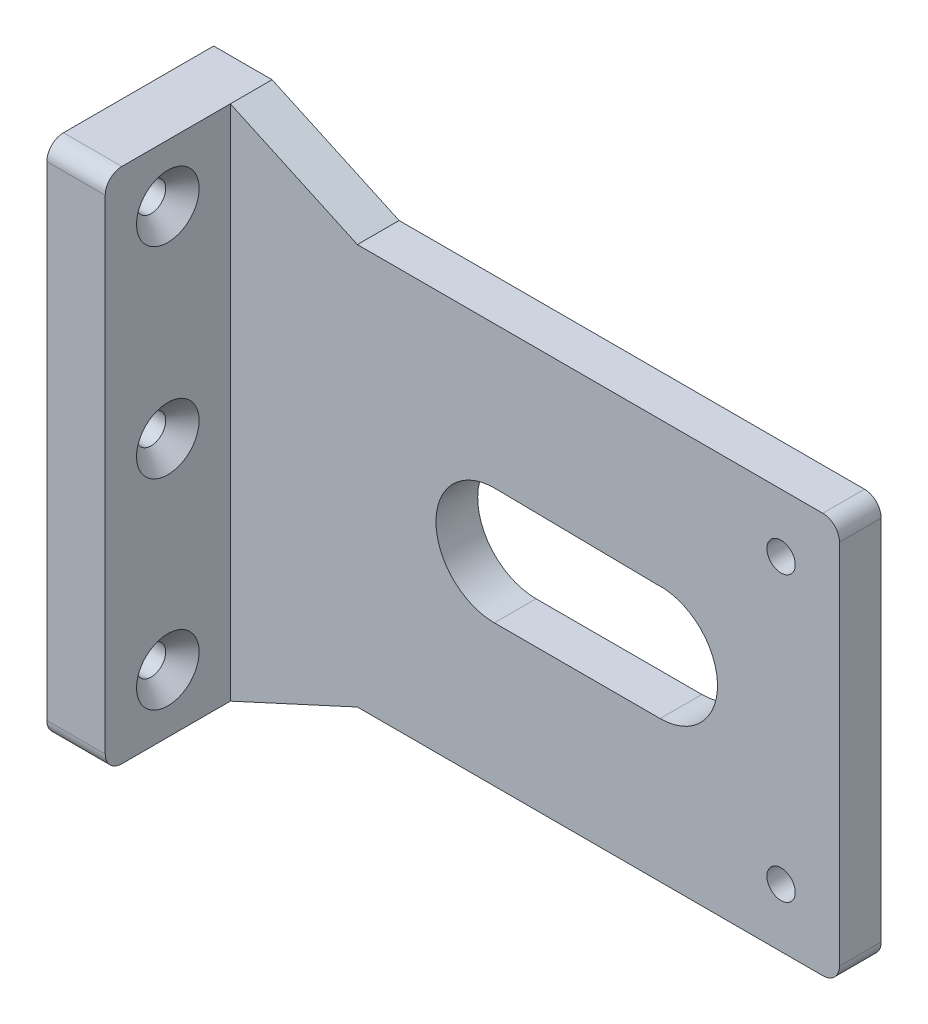
ISO-10303-21;
HEADER;
FILE_DESCRIPTION(('STEP AP214'),'2;1');
FILE_NAME('part.step','',(''),(''),'','','');
FILE_SCHEMA(('AUTOMOTIVE_DESIGN { 1 0 10303 214 1 1 1 1 }'));
ENDSEC;
DATA;
#1=APPLICATION_CONTEXT('core data for automotive mechanical design processes');
#2=APPLICATION_PROTOCOL_DEFINITION('international standard','automotive_design',2000,#1);
#3=PRODUCT_CONTEXT('',#1,'mechanical');
#4=PRODUCT('Part','Part','',(#3));
#5=PRODUCT_RELATED_PRODUCT_CATEGORY('part','',(#4));
#6=PRODUCT_DEFINITION_FORMATION('','',#4);
#7=PRODUCT_DEFINITION_CONTEXT('part definition',#1,'design');
#8=PRODUCT_DEFINITION('design','',#6,#7);
#9=PRODUCT_DEFINITION_SHAPE('','',#8);
#10=(LENGTH_UNIT() NAMED_UNIT(*) SI_UNIT(.MILLI.,.METRE.));
#11=(NAMED_UNIT(*) PLANE_ANGLE_UNIT() SI_UNIT($,.RADIAN.));
#12=(NAMED_UNIT(*) SI_UNIT($,.STERADIAN.) SOLID_ANGLE_UNIT());
#13=UNCERTAINTY_MEASURE_WITH_UNIT(LENGTH_MEASURE(1.E-05),#10,'distance_accuracy_value','');
#14=(GEOMETRIC_REPRESENTATION_CONTEXT(3) GLOBAL_UNCERTAINTY_ASSIGNED_CONTEXT((#13)) GLOBAL_UNIT_ASSIGNED_CONTEXT((#10,
#11,#12)) REPRESENTATION_CONTEXT('',''));
#15=CARTESIAN_POINT('',(0.,0.,0.));
#16=DIRECTION('',(0.,0.,1.));
#17=DIRECTION('',(1.,0.,0.));
#18=AXIS2_PLACEMENT_3D('',#15,#16,#17);
#19=CARTESIAN_POINT('',(-26.4932645391117,23.8191772918906,5.));
#20=DIRECTION('',(0.,0.,-1.));
#21=DIRECTION('',(-1.,0.,0.));
#22=AXIS2_PLACEMENT_3D('',#19,#20,#21);
#23=CYLINDRICAL_SURFACE('',#22,6.87362968464459);
#24=CARTESIAN_POINT('',(-26.4932645391117,23.8191772918906,0.));
#25=DIRECTION('',(0.,0.,1.));
#26=DIRECTION('',(1.,0.,0.));
#27=AXIS2_PLACEMENT_3D('',#24,#25,#26);
#28=CIRCLE('',#27,6.87362968464459);
#29=CARTESIAN_POINT('',(-26.4932645391116,16.9455476072461,0.));
#30=VERTEX_POINT('',#29);
#31=CARTESIAN_POINT('',(-27.0133943087637,30.6730995313349,0.));
#32=VERTEX_POINT('',#31);
#33=EDGE_CURVE('E248',#30,#32,#28,.T.);
#34=ORIENTED_EDGE('',*,*,#33,.F.);
#35=DIRECTION('',(0.,0.,-1.));
#36=VECTOR('',#35,1.);
#37=CARTESIAN_POINT('',(-26.4932645391116,16.9455476072461,5.));
#38=LINE('',#37,#36);
#39=CARTESIAN_POINT('',(-26.4932645391116,16.9455476072461,5.));
#40=VERTEX_POINT('',#39);
#41=EDGE_CURVE('E263',#40,#30,#38,.T.);
#42=ORIENTED_EDGE('',*,*,#41,.F.);
#43=CARTESIAN_POINT('',(-26.4932645391117,23.8191772918906,5.));
#44=DIRECTION('',(0.,0.,1.));
#45=DIRECTION('',(1.,0.,0.));
#46=AXIS2_PLACEMENT_3D('',#43,#44,#45);
#47=CIRCLE('',#46,6.87362968464459);
#48=CARTESIAN_POINT('',(-27.0133943087637,30.6730995313349,5.));
#49=VERTEX_POINT('',#48);
#50=EDGE_CURVE('E212',#40,#49,#47,.T.);
#51=ORIENTED_EDGE('',*,*,#50,.T.);
#52=DIRECTION('',(0.,0.,-1.));
#53=VECTOR('',#52,1.);
#54=CARTESIAN_POINT('',(-27.0133943087637,30.6730995313349,5.));
#55=LINE('',#54,#53);
#56=EDGE_CURVE('E256',#49,#32,#55,.T.);
#57=ORIENTED_EDGE('',*,*,#56,.T.);
#58=EDGE_LOOP('',(#34,#42,#51,#57));
#59=FACE_BOUND('',#58,.T.);
#60=ADVANCED_FACE('F35',(#59),#23,.F.);
#61=CARTESIAN_POINT('',(0.,16.9455476072461,5.));
#62=DIRECTION('',(0.,-1.,0.));
#63=DIRECTION('',(1.,0.,0.));
#64=AXIS2_PLACEMENT_3D('',#61,#62,#63);
#65=PLANE('',#64);
#66=DIRECTION('',(-1.,0.,0.));
#67=VECTOR('',#66,1.);
#68=CARTESIAN_POINT('',(0.,16.9455476072461,0.));
#69=LINE('',#68,#67);
#70=CARTESIAN_POINT('',(-46.3600354353213,16.9455476072461,0.));
#71=VERTEX_POINT('',#70);
#72=EDGE_CURVE('E251',#30,#71,#69,.T.);
#73=ORIENTED_EDGE('',*,*,#72,.T.);
#74=DIRECTION('',(0.,0.,-1.));
#75=VECTOR('',#74,1.);
#76=CARTESIAN_POINT('',(-46.3600354353213,16.9455476072461,5.));
#77=LINE('',#76,#75);
#78=CARTESIAN_POINT('',(-46.3600354353213,16.9455476072461,5.));
#79=VERTEX_POINT('',#78);
#80=EDGE_CURVE('E261',#79,#71,#77,.T.);
#81=ORIENTED_EDGE('',*,*,#80,.F.);
#82=DIRECTION('',(-1.,0.,0.));
#83=VECTOR('',#82,1.);
#84=CARTESIAN_POINT('',(0.,16.9455476072461,5.));
#85=LINE('',#84,#83);
#86=EDGE_CURVE('E215',#40,#79,#85,.T.);
#87=ORIENTED_EDGE('',*,*,#86,.F.);
#88=ORIENTED_EDGE('',*,*,#41,.T.);
#89=EDGE_LOOP('',(#73,#81,#87,#88));
#90=FACE_BOUND('',#89,.T.);
#91=ADVANCED_FACE('F366',(#90),#65,.F.);
#92=CARTESIAN_POINT('',(-46.3600354353213,23.9455476072461,5.));
#93=DIRECTION('',(0.,0.,-1.));
#94=DIRECTION('',(-1.,0.,0.));
#95=AXIS2_PLACEMENT_3D('',#92,#93,#94);
#96=CYLINDRICAL_SURFACE('',#95,7.);
#97=CARTESIAN_POINT('',(-46.3600354353213,23.9455476072461,0.));
#98=DIRECTION('',(0.,0.,1.));
#99=DIRECTION('',(1.,0.,0.));
#100=AXIS2_PLACEMENT_3D('',#97,#98,#99);
#101=CIRCLE('',#100,7.);
#102=CARTESIAN_POINT('',(-46.1629202483037,30.9427717427906,0.));
#103=VERTEX_POINT('',#102);
#104=EDGE_CURVE('E198',#103,#71,#101,.T.);
#105=ORIENTED_EDGE('',*,*,#104,.F.);
#106=DIRECTION('',(0.,0.,-1.));
#107=VECTOR('',#106,1.);
#108=CARTESIAN_POINT('',(-46.1629202483037,30.9427717427906,5.));
#109=LINE('',#108,#107);
#110=CARTESIAN_POINT('',(-46.1629202483037,30.9427717427906,5.));
#111=VERTEX_POINT('',#110);
#112=EDGE_CURVE('E258',#111,#103,#109,.T.);
#113=ORIENTED_EDGE('',*,*,#112,.F.);
#114=CARTESIAN_POINT('',(-46.3600354353213,23.9455476072461,5.));
#115=DIRECTION('',(0.,0.,1.));
#116=DIRECTION('',(1.,0.,0.));
#117=AXIS2_PLACEMENT_3D('',#114,#115,#116);
#118=CIRCLE('',#117,7.);
#119=EDGE_CURVE('E217',#111,#79,#118,.T.);
#120=ORIENTED_EDGE('',*,*,#119,.T.);
#121=ORIENTED_EDGE('',*,*,#80,.T.);
#122=EDGE_LOOP('',(#105,#113,#120,#121));
#123=FACE_BOUND('',#122,.T.);
#124=ADVANCED_FACE('F372',(#123),#96,.F.);
#125=CARTESIAN_POINT('',(0.,55.,5.));
#126=DIRECTION('',(0.,1.,0.));
#127=DIRECTION('',(0.,0.,1.));
#128=AXIS2_PLACEMENT_3D('',#125,#126,#127);
#129=PLANE('',#128);
#130=DIRECTION('',(0.,0.,-1.));
#131=VECTOR('',#130,1.);
#132=CARTESIAN_POINT('',(-85.,55.,5.));
#133=LINE('',#132,#131);
#134=CARTESIAN_POINT('',(-85.,55.,18.));
#135=VERTEX_POINT('',#134);
#136=CARTESIAN_POINT('',(-85.,55.,0.));
#137=VERTEX_POINT('',#136);
#138=EDGE_CURVE('E259',#135,#137,#133,.T.);
#139=ORIENTED_EDGE('',*,*,#138,.F.);
#140=DIRECTION('',(1.,0.,0.));
#141=VECTOR('',#140,1.);
#142=CARTESIAN_POINT('',(0.,55.,18.));
#143=LINE('',#142,#141);
#144=CARTESIAN_POINT('',(-78.,55.,18.));
#145=VERTEX_POINT('',#144);
#146=EDGE_CURVE('E308',#135,#145,#143,.T.);
#147=ORIENTED_EDGE('',*,*,#146,.T.);
#148=DIRECTION('',(0.,0.,-1.));
#149=VECTOR('',#148,1.);
#150=CARTESIAN_POINT('',(-78.,55.,20.));
#151=LINE('',#150,#149);
#152=CARTESIAN_POINT('',(-78.,55.,5.));
#153=VERTEX_POINT('',#152);
#154=EDGE_CURVE('E165',#145,#153,#151,.T.);
#155=ORIENTED_EDGE('',*,*,#154,.T.);
#156=DIRECTION('',(0.,0.,-1.));
#157=VECTOR('',#156,1.);
#158=CARTESIAN_POINT('',(-78.,55.,5.));
#159=LINE('',#158,#157);
#160=CARTESIAN_POINT('',(-78.,55.,0.));
#161=VERTEX_POINT('',#160);
#162=EDGE_CURVE('E222',#153,#161,#159,.T.);
#163=ORIENTED_EDGE('',*,*,#162,.T.);
#164=DIRECTION('',(1.,0.,0.));
#165=VECTOR('',#164,1.);
#166=CARTESIAN_POINT('',(0.,55.,0.));
#167=LINE('',#166,#165);
#168=EDGE_CURVE('E177',#137,#161,#167,.T.);
#169=ORIENTED_EDGE('',*,*,#168,.F.);
#170=EDGE_LOOP('',(#139,#147,#155,#163,#169));
#171=FACE_BOUND('',#170,.T.);
#172=ADVANCED_FACE('F328',(#171),#129,.T.);
#173=CARTESIAN_POINT('',(-85.,0.,5.));
#174=DIRECTION('',(1.,0.,0.));
#175=DIRECTION('',(0.,0.,-1.));
#176=AXIS2_PLACEMENT_3D('',#173,#174,#175);
#177=PLANE('',#176);
#178=CARTESIAN_POINT('',(-85.,24.,12.5));
#179=DIRECTION('',(1.,0.,0.));
#180=DIRECTION('',(0.,0.,-1.));
#181=AXIS2_PLACEMENT_3D('',#178,#179,#180);
#182=CIRCLE('',#181,1.75);
#183=CARTESIAN_POINT('',(-85.,24.,10.75));
#184=VERTEX_POINT('',#183);
#185=EDGE_CURVE('E341',#184,#184,#182,.T.);
#186=ORIENTED_EDGE('',*,*,#185,.T.);
#187=EDGE_LOOP('',(#186));
#188=FACE_BOUND('',#187,.T.);
#189=CARTESIAN_POINT('',(-85.,48.1060776493848,12.5));
#190=DIRECTION('',(1.,0.,0.));
#191=DIRECTION('',(0.,0.,-1.));
#192=AXIS2_PLACEMENT_3D('',#189,#190,#191);
#193=CIRCLE('',#192,1.75);
#194=CARTESIAN_POINT('',(-85.,48.1060776493848,10.75));
#195=VERTEX_POINT('',#194);
#196=EDGE_CURVE('E344',#195,#195,#193,.T.);
#197=ORIENTED_EDGE('',*,*,#196,.T.);
#198=EDGE_LOOP('',(#197));
#199=FACE_BOUND('',#198,.T.);
#200=CARTESIAN_POINT('',(-85.,0.,12.5));
#201=DIRECTION('',(1.,0.,0.));
#202=DIRECTION('',(0.,0.,-1.));
#203=AXIS2_PLACEMENT_3D('',#200,#201,#202);
#204=CIRCLE('',#203,1.75);
#205=CARTESIAN_POINT('',(-85.,0.,10.75));
#206=VERTEX_POINT('',#205);
#207=EDGE_CURVE('E336',#206,#206,#204,.T.);
#208=ORIENTED_EDGE('',*,*,#207,.T.);
#209=EDGE_LOOP('',(#208));
#210=FACE_BOUND('',#209,.T.);
#211=DIRECTION('',(0.,-1.,0.));
#212=VECTOR('',#211,1.);
#213=CARTESIAN_POINT('',(-85.,0.,20.));
#214=LINE('',#213,#212);
#215=CARTESIAN_POINT('',(-85.,53.,20.));
#216=VERTEX_POINT('',#215);
#217=CARTESIAN_POINT('',(-85.,-5.,20.));
#218=VERTEX_POINT('',#217);
#219=EDGE_CURVE('E322',#216,#218,#214,.T.);
#220=ORIENTED_EDGE('',*,*,#219,.F.);
#221=CARTESIAN_POINT('',(-85.,53.,18.));
#222=DIRECTION('',(1.,0.,0.));
#223=DIRECTION('',(0.,0.,-1.));
#224=AXIS2_PLACEMENT_3D('',#221,#222,#223);
#225=CIRCLE('',#224,2.);
#226=EDGE_CURVE('E43',#216,#135,#225,.F.);
#227=ORIENTED_EDGE('',*,*,#226,.T.);
#228=ORIENTED_EDGE('',*,*,#138,.T.);
#229=DIRECTION('',(0.,-1.,0.));
#230=VECTOR('',#229,1.);
#231=CARTESIAN_POINT('',(-85.,0.,0.));
#232=LINE('',#231,#230);
#233=CARTESIAN_POINT('',(-85.,-7.,0.));
#234=VERTEX_POINT('',#233);
#235=EDGE_CURVE('E225',#137,#234,#232,.T.);
#236=ORIENTED_EDGE('',*,*,#235,.T.);
#237=DIRECTION('',(0.,0.,-1.));
#238=VECTOR('',#237,1.);
#239=CARTESIAN_POINT('',(-85.,-7.,5.));
#240=LINE('',#239,#238);
#241=CARTESIAN_POINT('',(-85.,-7.,18.));
#242=VERTEX_POINT('',#241);
#243=EDGE_CURVE('E187',#242,#234,#240,.T.);
#244=ORIENTED_EDGE('',*,*,#243,.F.);
#245=CARTESIAN_POINT('',(-85.,-5.,18.));
#246=DIRECTION('',(1.,0.,0.));
#247=DIRECTION('',(0.,0.,-1.));
#248=AXIS2_PLACEMENT_3D('',#245,#246,#247);
#249=CIRCLE('',#248,2.);
#250=EDGE_CURVE('E50',#242,#218,#249,.F.);
#251=ORIENTED_EDGE('',*,*,#250,.T.);
#252=EDGE_LOOP('',(#220,#227,#228,#236,#244,#251));
#253=FACE_BOUND('',#252,.T.);
#254=ADVANCED_FACE('F320',(#188,#199,#210,#253),#177,.F.);
#255=CARTESIAN_POINT('',(0.,-7.,5.));
#256=DIRECTION('',(0.,-1.,0.));
#257=DIRECTION('',(0.,0.,-1.));
#258=AXIS2_PLACEMENT_3D('',#255,#256,#257);
#259=PLANE('',#258);
#260=DIRECTION('',(0.,0.,-1.));
#261=VECTOR('',#260,1.);
#262=CARTESIAN_POINT('',(-78.,-7.,20.));
#263=LINE('',#262,#261);
#264=CARTESIAN_POINT('',(-78.,-7.,18.));
#265=VERTEX_POINT('',#264);
#266=CARTESIAN_POINT('',(-78.,-7.,5.));
#267=VERTEX_POINT('',#266);
#268=EDGE_CURVE('E154',#265,#267,#263,.T.);
#269=ORIENTED_EDGE('',*,*,#268,.F.);
#270=DIRECTION('',(-1.,0.,0.));
#271=VECTOR('',#270,1.);
#272=CARTESIAN_POINT('',(0.,-7.,18.));
#273=LINE('',#272,#271);
#274=EDGE_CURVE('E11',#265,#242,#273,.T.);
#275=ORIENTED_EDGE('',*,*,#274,.T.);
#276=ORIENTED_EDGE('',*,*,#243,.T.);
#277=DIRECTION('',(-1.,0.,0.));
#278=VECTOR('',#277,1.);
#279=CARTESIAN_POINT('',(0.,-7.,0.));
#280=LINE('',#279,#278);
#281=CARTESIAN_POINT('',(-78.,-7.,0.));
#282=VERTEX_POINT('',#281);
#283=EDGE_CURVE('E183',#282,#234,#280,.T.);
#284=ORIENTED_EDGE('',*,*,#283,.F.);
#285=DIRECTION('',(0.,0.,-1.));
#286=VECTOR('',#285,1.);
#287=CARTESIAN_POINT('',(-78.,-7.,5.));
#288=LINE('',#287,#286);
#289=EDGE_CURVE('E180',#267,#282,#288,.T.);
#290=ORIENTED_EDGE('',*,*,#289,.F.);
#291=EDGE_LOOP('',(#269,#275,#276,#284,#290));
#292=FACE_BOUND('',#291,.T.);
#293=ADVANCED_FACE('F181',(#292),#259,.T.);
#294=CARTESIAN_POINT('',(-10.9580010754682,23.8294035119056,5.));
#295=DIRECTION('',(0.417794694081964,-0.908541464984927,0.));
#296=DIRECTION('',(0.908541464984927,0.417794694081964,0.));
#297=AXIS2_PLACEMENT_3D('',#294,#295,#296);
#298=PLANE('',#297);
#299=DIRECTION('',(-0.908541464984927,-0.417794694081964,0.));
#300=VECTOR('',#299,1.);
#301=CARTESIAN_POINT('',(-10.9580010754682,23.8294035119056,0.));
#302=LINE('',#301,#300);
#303=CARTESIAN_POINT('',(-62.7777141620501,0.,0.));
#304=VERTEX_POINT('',#303);
#305=EDGE_CURVE('E229',#304,#282,#302,.T.);
#306=ORIENTED_EDGE('',*,*,#305,.F.);
#307=DIRECTION('',(0.,0.,-1.));
#308=VECTOR('',#307,1.);
#309=CARTESIAN_POINT('',(-62.7777141620501,0.,5.));
#310=LINE('',#309,#308);
#311=CARTESIAN_POINT('',(-62.7777141620501,0.,5.));
#312=VERTEX_POINT('',#311);
#313=EDGE_CURVE('E188',#312,#304,#310,.T.);
#314=ORIENTED_EDGE('',*,*,#313,.F.);
#315=DIRECTION('',(-0.908541464984927,-0.417794694081964,0.));
#316=VECTOR('',#315,1.);
#317=CARTESIAN_POINT('',(-10.9580010754682,23.8294035119056,5.));
#318=LINE('',#317,#316);
#319=EDGE_CURVE('E174',#312,#267,#318,.T.);
#320=ORIENTED_EDGE('',*,*,#319,.T.);
#321=ORIENTED_EDGE('',*,*,#289,.T.);
#322=EDGE_LOOP('',(#306,#314,#320,#321));
#323=FACE_BOUND('',#322,.T.);
#324=ADVANCED_FACE('F190',(#323),#298,.T.);
#325=CARTESIAN_POINT('',(0.,0.,5.));
#326=DIRECTION('',(0.,1.,0.));
#327=DIRECTION('',(-1.,0.,0.));
#328=AXIS2_PLACEMENT_3D('',#325,#326,#327);
#329=PLANE('',#328);
#330=DIRECTION('',(1.,0.,0.));
#331=VECTOR('',#330,1.);
#332=CARTESIAN_POINT('',(0.,0.,0.));
#333=LINE('',#332,#331);
#334=CARTESIAN_POINT('',(-7.,0.,0.));
#335=VERTEX_POINT('',#334);
#336=EDGE_CURVE('E231',#304,#335,#333,.T.);
#337=ORIENTED_EDGE('',*,*,#336,.T.);
#338=DIRECTION('',(0.,0.,-1.));
#339=VECTOR('',#338,1.);
#340=CARTESIAN_POINT('',(-7.,0.,5.));
#341=LINE('',#340,#339);
#342=CARTESIAN_POINT('',(-7.,0.,5.));
#343=VERTEX_POINT('',#342);
#344=EDGE_CURVE('E299',#335,#343,#341,.F.);
#345=ORIENTED_EDGE('',*,*,#344,.T.);
#346=DIRECTION('',(1.,0.,0.));
#347=VECTOR('',#346,1.);
#348=CARTESIAN_POINT('',(0.,0.,5.));
#349=LINE('',#348,#347);
#350=EDGE_CURVE('E192',#312,#343,#349,.T.);
#351=ORIENTED_EDGE('',*,*,#350,.F.);
#352=ORIENTED_EDGE('',*,*,#313,.T.);
#353=EDGE_LOOP('',(#337,#345,#351,#352));
#354=FACE_BOUND('',#353,.T.);
#355=ADVANCED_FACE('F398',(#354),#329,.F.);
#356=CARTESIAN_POINT('',(-5.,0.,5.));
#357=DIRECTION('',(-1.,0.,0.));
#358=DIRECTION('',(0.,0.,1.));
#359=AXIS2_PLACEMENT_3D('',#356,#357,#358);
#360=PLANE('',#359);
#361=DIRECTION('',(0.,1.,0.));
#362=VECTOR('',#361,1.);
#363=CARTESIAN_POINT('',(-5.,0.,5.));
#364=LINE('',#363,#362);
#365=CARTESIAN_POINT('',(-5.,2.,5.));
#366=VERTEX_POINT('',#365);
#367=CARTESIAN_POINT('',(-5.,46.,5.));
#368=VERTEX_POINT('',#367);
#369=EDGE_CURVE('E195',#366,#368,#364,.T.);
#370=ORIENTED_EDGE('',*,*,#369,.F.);
#371=DIRECTION('',(0.,0.,-1.));
#372=VECTOR('',#371,1.);
#373=CARTESIAN_POINT('',(-5.,2.,5.));
#374=LINE('',#373,#372);
#375=CARTESIAN_POINT('',(-5.,2.,0.));
#376=VERTEX_POINT('',#375);
#377=EDGE_CURVE('E292',#366,#376,#374,.T.);
#378=ORIENTED_EDGE('',*,*,#377,.T.);
#379=DIRECTION('',(0.,1.,0.));
#380=VECTOR('',#379,1.);
#381=CARTESIAN_POINT('',(-5.,0.,0.));
#382=LINE('',#381,#380);
#383=CARTESIAN_POINT('',(-5.,46.,0.));
#384=VERTEX_POINT('',#383);
#385=EDGE_CURVE('E234',#376,#384,#382,.T.);
#386=ORIENTED_EDGE('',*,*,#385,.T.);
#387=DIRECTION('',(0.,0.,-1.));
#388=VECTOR('',#387,1.);
#389=CARTESIAN_POINT('',(-5.,46.,5.));
#390=LINE('',#389,#388);
#391=EDGE_CURVE('E290',#384,#368,#390,.F.);
#392=ORIENTED_EDGE('',*,*,#391,.T.);
#393=EDGE_LOOP('',(#370,#378,#386,#392));
#394=FACE_BOUND('',#393,.T.);
#395=ADVANCED_FACE('F394',(#394),#360,.F.);
#396=CARTESIAN_POINT('',(0.,48.,5.));
#397=DIRECTION('',(0.,-1.,0.));
#398=DIRECTION('',(1.,0.,0.));
#399=AXIS2_PLACEMENT_3D('',#396,#397,#398);
#400=PLANE('',#399);
#401=DIRECTION('',(-1.,0.,0.));
#402=VECTOR('',#401,1.);
#403=CARTESIAN_POINT('',(0.,48.,5.));
#404=LINE('',#403,#402);
#405=CARTESIAN_POINT('',(-7.,48.,5.));
#406=VERTEX_POINT('',#405);
#407=CARTESIAN_POINT('',(-62.7777141620501,48.,5.));
#408=VERTEX_POINT('',#407);
#409=EDGE_CURVE('E203',#406,#408,#404,.T.);
#410=ORIENTED_EDGE('',*,*,#409,.F.);
#411=DIRECTION('',(0.,0.,-1.));
#412=VECTOR('',#411,1.);
#413=CARTESIAN_POINT('',(-7.,48.,5.));
#414=LINE('',#413,#412);
#415=CARTESIAN_POINT('',(-7.,48.,0.));
#416=VERTEX_POINT('',#415);
#417=EDGE_CURVE('E305',#406,#416,#414,.T.);
#418=ORIENTED_EDGE('',*,*,#417,.T.);
#419=DIRECTION('',(-1.,0.,0.));
#420=VECTOR('',#419,1.);
#421=CARTESIAN_POINT('',(0.,48.,0.));
#422=LINE('',#421,#420);
#423=CARTESIAN_POINT('',(-62.7777141620501,48.,0.));
#424=VERTEX_POINT('',#423);
#425=EDGE_CURVE('E237',#416,#424,#422,.T.);
#426=ORIENTED_EDGE('',*,*,#425,.T.);
#427=DIRECTION('',(0.,0.,-1.));
#428=VECTOR('',#427,1.);
#429=CARTESIAN_POINT('',(-62.7777141620501,48.,5.));
#430=LINE('',#429,#428);
#431=EDGE_CURVE('E267',#408,#424,#430,.T.);
#432=ORIENTED_EDGE('',*,*,#431,.F.);
#433=EDGE_LOOP('',(#410,#418,#426,#432));
#434=FACE_BOUND('',#433,.T.);
#435=ADVANCED_FACE('F382',(#434),#400,.F.);
#436=CARTESIAN_POINT('',(-12.,7.,5.));
#437=DIRECTION('',(0.,0.,-1.));
#438=DIRECTION('',(-1.,0.,0.));
#439=AXIS2_PLACEMENT_3D('',#436,#437,#438);
#440=CYLINDRICAL_SURFACE('',#439,1.7);
#441=CARTESIAN_POINT('',(-12.,7.,5.));
#442=DIRECTION('',(0.,0.,1.));
#443=DIRECTION('',(1.,0.,0.));
#444=AXIS2_PLACEMENT_3D('',#441,#442,#443);
#445=CIRCLE('',#444,1.7);
#446=CARTESIAN_POINT('',(-10.3,7.,5.));
#447=VERTEX_POINT('',#446);
#448=EDGE_CURVE('E209',#447,#447,#445,.T.);
#449=ORIENTED_EDGE('',*,*,#448,.T.);
#450=EDGE_LOOP('',(#449));
#451=FACE_BOUND('',#450,.T.);
#452=CARTESIAN_POINT('',(-12.,7.,0.));
#453=DIRECTION('',(0.,0.,1.));
#454=DIRECTION('',(1.,0.,0.));
#455=AXIS2_PLACEMENT_3D('',#452,#453,#454);
#456=CIRCLE('',#455,1.7);
#457=CARTESIAN_POINT('',(-10.3,7.,0.));
#458=VERTEX_POINT('',#457);
#459=EDGE_CURVE('E245',#458,#458,#456,.T.);
#460=ORIENTED_EDGE('',*,*,#459,.F.);
#461=EDGE_LOOP('',(#460));
#462=FACE_BOUND('',#461,.T.);
#463=ADVANCED_FACE('F378',(#451,#462),#440,.F.);
#464=CARTESIAN_POINT('',(-12.,41.,5.));
#465=DIRECTION('',(0.,0.,-1.));
#466=DIRECTION('',(-1.,0.,0.));
#467=AXIS2_PLACEMENT_3D('',#464,#465,#466);
#468=CYLINDRICAL_SURFACE('',#467,1.7);
#469=CARTESIAN_POINT('',(-12.,41.,5.));
#470=DIRECTION('',(0.,0.,1.));
#471=DIRECTION('',(1.,0.,0.));
#472=AXIS2_PLACEMENT_3D('',#469,#470,#471);
#473=CIRCLE('',#472,1.7);
#474=CARTESIAN_POINT('',(-10.3,41.,5.));
#475=VERTEX_POINT('',#474);
#476=EDGE_CURVE('E206',#475,#475,#473,.T.);
#477=ORIENTED_EDGE('',*,*,#476,.T.);
#478=EDGE_LOOP('',(#477));
#479=FACE_BOUND('',#478,.T.);
#480=CARTESIAN_POINT('',(-12.,41.,0.));
#481=DIRECTION('',(0.,0.,1.));
#482=DIRECTION('',(1.,0.,0.));
#483=AXIS2_PLACEMENT_3D('',#480,#481,#482);
#484=CIRCLE('',#483,1.7);
#485=CARTESIAN_POINT('',(-10.3,41.,0.));
#486=VERTEX_POINT('',#485);
#487=EDGE_CURVE('E242',#486,#486,#484,.T.);
#488=ORIENTED_EDGE('',*,*,#487,.F.);
#489=EDGE_LOOP('',(#488));
#490=FACE_BOUND('',#489,.T.);
#491=ADVANCED_FACE('F381',(#479,#490),#468,.F.);
#492=CARTESIAN_POINT('',(7.26202148889138,15.7920809807484,5.));
#493=DIRECTION('',(0.417794694081964,0.908541464984927,0.));
#494=DIRECTION('',(-0.908541464984927,0.417794694081964,0.));
#495=AXIS2_PLACEMENT_3D('',#492,#493,#494);
#496=PLANE('',#495);
#497=DIRECTION('',(0.908541464984927,-0.417794694081964,0.));
#498=VECTOR('',#497,1.);
#499=CARTESIAN_POINT('',(7.26202148889138,15.7920809807484,0.));
#500=LINE('',#499,#498);
#501=EDGE_CURVE('E239',#161,#424,#500,.T.);
#502=ORIENTED_EDGE('',*,*,#501,.F.);
#503=ORIENTED_EDGE('',*,*,#162,.F.);
#504=DIRECTION('',(0.908541464984927,-0.417794694081964,0.));
#505=VECTOR('',#504,1.);
#506=CARTESIAN_POINT('',(7.26202148889138,15.7920809807484,5.));
#507=LINE('',#506,#505);
#508=EDGE_CURVE('E176',#153,#408,#507,.T.);
#509=ORIENTED_EDGE('',*,*,#508,.T.);
#510=ORIENTED_EDGE('',*,*,#431,.T.);
#511=EDGE_LOOP('',(#502,#503,#509,#510));
#512=FACE_BOUND('',#511,.T.);
#513=ADVANCED_FACE('F386',(#512),#496,.T.);
#514=CARTESIAN_POINT('',(0.426510587817757,30.2866784857719,5.));
#515=DIRECTION('',(0.0140810522523411,0.999900857069073,0.));
#516=DIRECTION('',(-0.999900857069073,0.0140810522523411,0.));
#517=AXIS2_PLACEMENT_3D('',#514,#515,#516);
#518=PLANE('',#517);
#519=DIRECTION('',(0.999900857069073,-0.0140810522523411,0.));
#520=VECTOR('',#519,1.);
#521=CARTESIAN_POINT('',(0.426510587817757,30.2866784857719,0.));
#522=LINE('',#521,#520);
#523=EDGE_CURVE('E193',#103,#32,#522,.T.);
#524=ORIENTED_EDGE('',*,*,#523,.T.);
#525=ORIENTED_EDGE('',*,*,#56,.F.);
#526=DIRECTION('',(0.999900857069073,-0.0140810522523411,0.));
#527=VECTOR('',#526,1.);
#528=CARTESIAN_POINT('',(0.426510587817757,30.2866784857719,5.));
#529=LINE('',#528,#527);
#530=EDGE_CURVE('E220',#111,#49,#529,.T.);
#531=ORIENTED_EDGE('',*,*,#530,.F.);
#532=ORIENTED_EDGE('',*,*,#112,.T.);
#533=EDGE_LOOP('',(#524,#525,#531,#532));
#534=FACE_BOUND('',#533,.T.);
#535=ADVANCED_FACE('F390',(#534),#518,.F.);
#536=CARTESIAN_POINT('',(0.,0.,5.));
#537=DIRECTION('',(0.,0.,1.));
#538=DIRECTION('',(1.,0.,0.));
#539=AXIS2_PLACEMENT_3D('',#536,#537,#538);
#540=PLANE('',#539);
#541=ORIENTED_EDGE('',*,*,#350,.T.);
#542=CARTESIAN_POINT('',(-7.,2.,5.));
#543=DIRECTION('',(0.,0.,1.));
#544=DIRECTION('',(1.,0.,0.));
#545=AXIS2_PLACEMENT_3D('',#542,#543,#544);
#546=CIRCLE('',#545,2.);
#547=EDGE_CURVE('E303',#343,#366,#546,.T.);
#548=ORIENTED_EDGE('',*,*,#547,.T.);
#549=ORIENTED_EDGE('',*,*,#369,.T.);
#550=CARTESIAN_POINT('',(-7.,46.,5.));
#551=DIRECTION('',(0.,0.,1.));
#552=DIRECTION('',(1.,0.,0.));
#553=AXIS2_PLACEMENT_3D('',#550,#551,#552);
#554=CIRCLE('',#553,2.);
#555=EDGE_CURVE('E301',#368,#406,#554,.T.);
#556=ORIENTED_EDGE('',*,*,#555,.T.);
#557=ORIENTED_EDGE('',*,*,#409,.T.);
#558=ORIENTED_EDGE('',*,*,#508,.F.);
#559=DIRECTION('',(0.,1.,0.));
#560=VECTOR('',#559,1.);
#561=CARTESIAN_POINT('',(-78.,0.,5.));
#562=LINE('',#561,#560);
#563=EDGE_CURVE('E158',#267,#153,#562,.T.);
#564=ORIENTED_EDGE('',*,*,#563,.F.);
#565=ORIENTED_EDGE('',*,*,#319,.F.);
#566=EDGE_LOOP('',(#541,#548,#549,#556,#557,#558,#564,#565));
#567=FACE_BOUND('',#566,.T.);
#568=ORIENTED_EDGE('',*,*,#476,.F.);
#569=EDGE_LOOP('',(#568));
#570=FACE_BOUND('',#569,.T.);
#571=ORIENTED_EDGE('',*,*,#448,.F.);
#572=EDGE_LOOP('',(#571));
#573=FACE_BOUND('',#572,.T.);
#574=ORIENTED_EDGE('',*,*,#50,.F.);
#575=ORIENTED_EDGE('',*,*,#86,.T.);
#576=ORIENTED_EDGE('',*,*,#119,.F.);
#577=ORIENTED_EDGE('',*,*,#530,.T.);
#578=EDGE_LOOP('',(#574,#575,#576,#577));
#579=FACE_BOUND('',#578,.T.);
#580=ADVANCED_FACE('F171',(#567,#570,#573,#579),#540,.T.);
#581=CARTESIAN_POINT('',(0.,0.,0.));
#582=DIRECTION('',(0.,0.,1.));
#583=DIRECTION('',(1.,0.,0.));
#584=AXIS2_PLACEMENT_3D('',#581,#582,#583);
#585=PLANE('',#584);
#586=ORIENTED_EDGE('',*,*,#385,.F.);
#587=CARTESIAN_POINT('',(-7.,2.,0.));
#588=DIRECTION('',(0.,0.,1.));
#589=DIRECTION('',(1.,0.,0.));
#590=AXIS2_PLACEMENT_3D('',#587,#588,#589);
#591=CIRCLE('',#590,2.);
#592=EDGE_CURVE('E297',#376,#335,#591,.F.);
#593=ORIENTED_EDGE('',*,*,#592,.T.);
#594=ORIENTED_EDGE('',*,*,#336,.F.);
#595=ORIENTED_EDGE('',*,*,#305,.T.);
#596=ORIENTED_EDGE('',*,*,#283,.T.);
#597=ORIENTED_EDGE('',*,*,#235,.F.);
#598=ORIENTED_EDGE('',*,*,#168,.T.);
#599=ORIENTED_EDGE('',*,*,#501,.T.);
#600=ORIENTED_EDGE('',*,*,#425,.F.);
#601=CARTESIAN_POINT('',(-7.,46.,0.));
#602=DIRECTION('',(0.,0.,1.));
#603=DIRECTION('',(1.,0.,0.));
#604=AXIS2_PLACEMENT_3D('',#601,#602,#603);
#605=CIRCLE('',#604,2.);
#606=EDGE_CURVE('E295',#416,#384,#605,.F.);
#607=ORIENTED_EDGE('',*,*,#606,.T.);
#608=EDGE_LOOP('',(#586,#593,#594,#595,#596,#597,#598,#599,#600,#607));
#609=FACE_BOUND('',#608,.T.);
#610=ORIENTED_EDGE('',*,*,#487,.T.);
#611=EDGE_LOOP('',(#610));
#612=FACE_BOUND('',#611,.T.);
#613=ORIENTED_EDGE('',*,*,#459,.T.);
#614=EDGE_LOOP('',(#613));
#615=FACE_BOUND('',#614,.T.);
#616=ORIENTED_EDGE('',*,*,#33,.T.);
#617=ORIENTED_EDGE('',*,*,#523,.F.);
#618=ORIENTED_EDGE('',*,*,#104,.T.);
#619=ORIENTED_EDGE('',*,*,#72,.F.);
#620=EDGE_LOOP('',(#616,#617,#618,#619));
#621=FACE_BOUND('',#620,.T.);
#622=ADVANCED_FACE('F438',(#609,#612,#615,#621),#585,.F.);
#623=CARTESIAN_POINT('',(-78.,0.,20.));
#624=DIRECTION('',(1.,0.,0.));
#625=DIRECTION('',(0.,0.,-1.));
#626=AXIS2_PLACEMENT_3D('',#623,#624,#625);
#627=PLANE('',#626);
#628=CARTESIAN_POINT('',(-78.,48.1060776493848,12.5));
#629=DIRECTION('',(1.,0.,0.));
#630=DIRECTION('',(0.,0.,-1.));
#631=AXIS2_PLACEMENT_3D('',#628,#629,#630);
#632=CIRCLE('',#631,3.75);
#633=CARTESIAN_POINT('',(-78.,48.1060776493848,8.75));
#634=VERTEX_POINT('',#633);
#635=EDGE_CURVE('E281',#634,#634,#632,.F.);
#636=ORIENTED_EDGE('',*,*,#635,.T.);
#637=EDGE_LOOP('',(#636));
#638=FACE_BOUND('',#637,.T.);
#639=CARTESIAN_POINT('',(-78.,24.,12.5));
#640=DIRECTION('',(1.,0.,0.));
#641=DIRECTION('',(0.,0.,-1.));
#642=AXIS2_PLACEMENT_3D('',#639,#640,#641);
#643=CIRCLE('',#642,3.75);
#644=CARTESIAN_POINT('',(-78.,24.,8.75));
#645=VERTEX_POINT('',#644);
#646=EDGE_CURVE('E278',#645,#645,#643,.F.);
#647=ORIENTED_EDGE('',*,*,#646,.T.);
#648=EDGE_LOOP('',(#647));
#649=FACE_BOUND('',#648,.T.);
#650=CARTESIAN_POINT('',(-78.,0.,12.5));
#651=DIRECTION('',(1.,0.,0.));
#652=DIRECTION('',(0.,0.,-1.));
#653=AXIS2_PLACEMENT_3D('',#650,#651,#652);
#654=CIRCLE('',#653,3.75);
#655=CARTESIAN_POINT('',(-78.,0.,8.75));
#656=VERTEX_POINT('',#655);
#657=EDGE_CURVE('E275',#656,#656,#654,.F.);
#658=ORIENTED_EDGE('',*,*,#657,.T.);
#659=EDGE_LOOP('',(#658));
#660=FACE_BOUND('',#659,.T.);
#661=ORIENTED_EDGE('',*,*,#154,.F.);
#662=CARTESIAN_POINT('',(-78.,53.,18.));
#663=DIRECTION('',(1.,0.,0.));
#664=DIRECTION('',(0.,0.,-1.));
#665=AXIS2_PLACEMENT_3D('',#662,#663,#664);
#666=CIRCLE('',#665,2.);
#667=CARTESIAN_POINT('',(-78.,53.,20.));
#668=VERTEX_POINT('',#667);
#669=EDGE_CURVE('E312',#145,#668,#666,.T.);
#670=ORIENTED_EDGE('',*,*,#669,.T.);
#671=DIRECTION('',(0.,-1.,0.));
#672=VECTOR('',#671,1.);
#673=CARTESIAN_POINT('',(-78.,0.,20.));
#674=LINE('',#673,#672);
#675=CARTESIAN_POINT('',(-78.,-5.,20.));
#676=VERTEX_POINT('',#675);
#677=EDGE_CURVE('E331',#668,#676,#674,.T.);
#678=ORIENTED_EDGE('',*,*,#677,.T.);
#679=CARTESIAN_POINT('',(-78.,-5.,18.));
#680=DIRECTION('',(1.,0.,0.));
#681=DIRECTION('',(0.,0.,-1.));
#682=AXIS2_PLACEMENT_3D('',#679,#680,#681);
#683=CIRCLE('',#682,2.);
#684=EDGE_CURVE('E162',#676,#265,#683,.T.);
#685=ORIENTED_EDGE('',*,*,#684,.T.);
#686=ORIENTED_EDGE('',*,*,#268,.T.);
#687=ORIENTED_EDGE('',*,*,#563,.T.);
#688=EDGE_LOOP('',(#661,#670,#678,#685,#686,#687));
#689=FACE_BOUND('',#688,.T.);
#690=ADVANCED_FACE('F157',(#638,#649,#660,#689),#627,.T.);
#691=CARTESIAN_POINT('',(0.,0.,20.));
#692=DIRECTION('',(0.,0.,1.));
#693=DIRECTION('',(1.,0.,0.));
#694=AXIS2_PLACEMENT_3D('',#691,#692,#693);
#695=PLANE('',#694);
#696=ORIENTED_EDGE('',*,*,#677,.F.);
#697=DIRECTION('',(1.,0.,0.));
#698=VECTOR('',#697,1.);
#699=CARTESIAN_POINT('',(0.,53.,20.));
#700=LINE('',#699,#698);
#701=EDGE_CURVE('E316',#668,#216,#700,.F.);
#702=ORIENTED_EDGE('',*,*,#701,.T.);
#703=ORIENTED_EDGE('',*,*,#219,.T.);
#704=DIRECTION('',(-1.,0.,0.));
#705=VECTOR('',#704,1.);
#706=CARTESIAN_POINT('',(0.,-5.,20.));
#707=LINE('',#706,#705);
#708=EDGE_CURVE('E314',#218,#676,#707,.F.);
#709=ORIENTED_EDGE('',*,*,#708,.T.);
#710=EDGE_LOOP('',(#696,#702,#703,#709));
#711=FACE_BOUND('',#710,.T.);
#712=ADVANCED_FACE('F333',(#711),#695,.T.);
#713=CARTESIAN_POINT('',(-96.,0.,12.5));
#714=DIRECTION('',(1.,0.,0.));
#715=DIRECTION('',(0.,0.,-1.));
#716=AXIS2_PLACEMENT_3D('',#713,#714,#715);
#717=CYLINDRICAL_SURFACE('',#716,1.75);
#718=CARTESIAN_POINT('',(-80.,0.,12.5));
#719=DIRECTION('',(1.,0.,0.));
#720=DIRECTION('',(0.,0.,-1.));
#721=AXIS2_PLACEMENT_3D('',#718,#719,#720);
#722=CIRCLE('',#721,1.75);
#723=CARTESIAN_POINT('',(-80.,0.,10.75));
#724=VERTEX_POINT('',#723);
#725=EDGE_CURVE('E287',#724,#724,#722,.T.);
#726=ORIENTED_EDGE('',*,*,#725,.T.);
#727=EDGE_LOOP('',(#726));
#728=FACE_BOUND('',#727,.T.);
#729=ORIENTED_EDGE('',*,*,#207,.F.);
#730=EDGE_LOOP('',(#729));
#731=FACE_BOUND('',#730,.T.);
#732=ADVANCED_FACE('F353',(#728,#731),#717,.F.);
#733=CARTESIAN_POINT('',(-96.,48.1060776493848,12.5));
#734=DIRECTION('',(1.,0.,0.));
#735=DIRECTION('',(0.,0.,-1.));
#736=AXIS2_PLACEMENT_3D('',#733,#734,#735);
#737=CYLINDRICAL_SURFACE('',#736,1.75);
#738=CARTESIAN_POINT('',(-80.,48.1060776493848,12.5));
#739=DIRECTION('',(1.,0.,0.));
#740=DIRECTION('',(0.,0.,-1.));
#741=AXIS2_PLACEMENT_3D('',#738,#739,#740);
#742=CIRCLE('',#741,1.75);
#743=CARTESIAN_POINT('',(-80.,48.1060776493848,10.75));
#744=VERTEX_POINT('',#743);
#745=EDGE_CURVE('E265',#744,#744,#742,.T.);
#746=ORIENTED_EDGE('',*,*,#745,.T.);
#747=EDGE_LOOP('',(#746));
#748=FACE_BOUND('',#747,.T.);
#749=ORIENTED_EDGE('',*,*,#196,.F.);
#750=EDGE_LOOP('',(#749));
#751=FACE_BOUND('',#750,.T.);
#752=ADVANCED_FACE('F350',(#748,#751),#737,.F.);
#753=CARTESIAN_POINT('',(-96.,24.,12.5));
#754=DIRECTION('',(1.,0.,0.));
#755=DIRECTION('',(0.,0.,-1.));
#756=AXIS2_PLACEMENT_3D('',#753,#754,#755);
#757=CYLINDRICAL_SURFACE('',#756,1.75);
#758=CARTESIAN_POINT('',(-80.,24.,12.5));
#759=DIRECTION('',(1.,0.,0.));
#760=DIRECTION('',(0.,0.,-1.));
#761=AXIS2_PLACEMENT_3D('',#758,#759,#760);
#762=CIRCLE('',#761,1.75);
#763=CARTESIAN_POINT('',(-80.,24.,10.75));
#764=VERTEX_POINT('',#763);
#765=EDGE_CURVE('E284',#764,#764,#762,.T.);
#766=ORIENTED_EDGE('',*,*,#765,.T.);
#767=EDGE_LOOP('',(#766));
#768=FACE_BOUND('',#767,.T.);
#769=ORIENTED_EDGE('',*,*,#185,.F.);
#770=EDGE_LOOP('',(#769));
#771=FACE_BOUND('',#770,.T.);
#772=ADVANCED_FACE('F352',(#768,#771),#757,.F.);
#773=CARTESIAN_POINT('',(-80.,48.1060776493848,12.5));
#774=DIRECTION('',(1.,0.,0.));
#775=DIRECTION('',(0.,0.,-1.));
#776=AXIS2_PLACEMENT_3D('',#773,#774,#775);
#777=CONICAL_SURFACE('',#776,1.75,0.785398163397452);
#778=ORIENTED_EDGE('',*,*,#635,.F.);
#779=EDGE_LOOP('',(#778));
#780=FACE_BOUND('',#779,.T.);
#781=ORIENTED_EDGE('',*,*,#745,.F.);
#782=EDGE_LOOP('',(#781));
#783=FACE_BOUND('',#782,.T.);
#784=ADVANCED_FACE('F360',(#780,#783),#777,.F.);
#785=CARTESIAN_POINT('',(-80.,24.,12.5));
#786=DIRECTION('',(1.,0.,0.));
#787=DIRECTION('',(0.,0.,-1.));
#788=AXIS2_PLACEMENT_3D('',#785,#786,#787);
#789=CONICAL_SURFACE('',#788,1.75,0.785398163397452);
#790=ORIENTED_EDGE('',*,*,#646,.F.);
#791=EDGE_LOOP('',(#790));
#792=FACE_BOUND('',#791,.T.);
#793=ORIENTED_EDGE('',*,*,#765,.F.);
#794=EDGE_LOOP('',(#793));
#795=FACE_BOUND('',#794,.T.);
#796=ADVANCED_FACE('F414',(#792,#795),#789,.F.);
#797=CARTESIAN_POINT('',(-80.,0.,12.5));
#798=DIRECTION('',(1.,0.,0.));
#799=DIRECTION('',(0.,0.,-1.));
#800=AXIS2_PLACEMENT_3D('',#797,#798,#799);
#801=CONICAL_SURFACE('',#800,1.75,0.785398163397452);
#802=ORIENTED_EDGE('',*,*,#657,.F.);
#803=EDGE_LOOP('',(#802));
#804=FACE_BOUND('',#803,.T.);
#805=ORIENTED_EDGE('',*,*,#725,.F.);
#806=EDGE_LOOP('',(#805));
#807=FACE_BOUND('',#806,.T.);
#808=ADVANCED_FACE('F418',(#804,#807),#801,.F.);
#809=CARTESIAN_POINT('',(-7.,2.,5.));
#810=DIRECTION('',(0.,0.,-1.));
#811=DIRECTION('',(-1.,0.,0.));
#812=AXIS2_PLACEMENT_3D('',#809,#810,#811);
#813=CYLINDRICAL_SURFACE('',#812,2.);
#814=ORIENTED_EDGE('',*,*,#547,.F.);
#815=ORIENTED_EDGE('',*,*,#344,.F.);
#816=ORIENTED_EDGE('',*,*,#592,.F.);
#817=ORIENTED_EDGE('',*,*,#377,.F.);
#818=EDGE_LOOP('',(#814,#815,#816,#817));
#819=FACE_BOUND('',#818,.T.);
#820=ADVANCED_FACE('F422',(#819),#813,.T.);
#821=CARTESIAN_POINT('',(-7.,46.,5.));
#822=DIRECTION('',(0.,0.,-1.));
#823=DIRECTION('',(-1.,0.,0.));
#824=AXIS2_PLACEMENT_3D('',#821,#822,#823);
#825=CYLINDRICAL_SURFACE('',#824,2.);
#826=ORIENTED_EDGE('',*,*,#555,.F.);
#827=ORIENTED_EDGE('',*,*,#391,.F.);
#828=ORIENTED_EDGE('',*,*,#606,.F.);
#829=ORIENTED_EDGE('',*,*,#417,.F.);
#830=EDGE_LOOP('',(#826,#827,#828,#829));
#831=FACE_BOUND('',#830,.T.);
#832=ADVANCED_FACE('F426',(#831),#825,.T.);
#833=CARTESIAN_POINT('',(0.,53.,18.));
#834=DIRECTION('',(1.,0.,0.));
#835=DIRECTION('',(0.,0.,-1.));
#836=AXIS2_PLACEMENT_3D('',#833,#834,#835);
#837=CYLINDRICAL_SURFACE('',#836,2.);
#838=ORIENTED_EDGE('',*,*,#226,.F.);
#839=ORIENTED_EDGE('',*,*,#701,.F.);
#840=ORIENTED_EDGE('',*,*,#669,.F.);
#841=ORIENTED_EDGE('',*,*,#146,.F.);
#842=EDGE_LOOP('',(#838,#839,#840,#841));
#843=FACE_BOUND('',#842,.T.);
#844=ADVANCED_FACE('F329',(#843),#837,.T.);
#845=CARTESIAN_POINT('',(0.,-5.,18.));
#846=DIRECTION('',(-1.,0.,0.));
#847=DIRECTION('',(0.,0.,1.));
#848=AXIS2_PLACEMENT_3D('',#845,#846,#847);
#849=CYLINDRICAL_SURFACE('',#848,2.);
#850=ORIENTED_EDGE('',*,*,#684,.F.);
#851=ORIENTED_EDGE('',*,*,#708,.F.);
#852=ORIENTED_EDGE('',*,*,#250,.F.);
#853=ORIENTED_EDGE('',*,*,#274,.F.);
#854=EDGE_LOOP('',(#850,#851,#852,#853));
#855=FACE_BOUND('',#854,.T.);
#856=ADVANCED_FACE('F37',(#855),#849,.T.);
#857=CLOSED_SHELL('',(#60,#91,#124,#172,#254,#293,#324,#355,#395,#435,#463,#491,#513,#535,#580,
#622,#690,#712,#732,#752,#772,#784,#796,#808,#820,#832,#844,#856));
#858=MANIFOLD_SOLID_BREP('B2',#857);
#859=ADVANCED_BREP_SHAPE_REPRESENTATION('',(#18,#858),#14);
#860=SHAPE_DEFINITION_REPRESENTATION(#9,#859);
ENDSEC;
END-ISO-10303-21;
